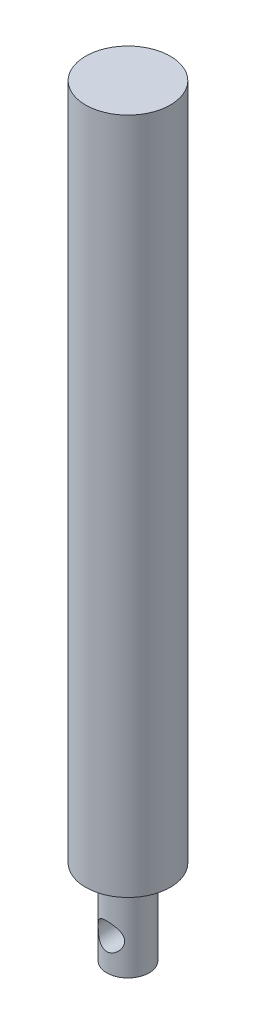
ISO-10303-21;
HEADER;
FILE_DESCRIPTION(('STEP AP214'),'2;1');
FILE_NAME('part.step','',(''),(''),'','','');
FILE_SCHEMA(('AUTOMOTIVE_DESIGN { 1 0 10303 214 1 1 1 1 }'));
ENDSEC;
DATA;
#1=APPLICATION_CONTEXT('core data for automotive mechanical design processes');
#2=APPLICATION_PROTOCOL_DEFINITION('international standard','automotive_design',2000,#1);
#3=PRODUCT_CONTEXT('',#1,'mechanical');
#4=PRODUCT('Part','Part','',(#3));
#5=PRODUCT_RELATED_PRODUCT_CATEGORY('part','',(#4));
#6=PRODUCT_DEFINITION_FORMATION('','',#4);
#7=PRODUCT_DEFINITION_CONTEXT('part definition',#1,'design');
#8=PRODUCT_DEFINITION('design','',#6,#7);
#9=PRODUCT_DEFINITION_SHAPE('','',#8);
#10=(LENGTH_UNIT() NAMED_UNIT(*) SI_UNIT(.MILLI.,.METRE.));
#11=(NAMED_UNIT(*) PLANE_ANGLE_UNIT() SI_UNIT($,.RADIAN.));
#12=(NAMED_UNIT(*) SI_UNIT($,.STERADIAN.) SOLID_ANGLE_UNIT());
#13=UNCERTAINTY_MEASURE_WITH_UNIT(LENGTH_MEASURE(1.E-05),#10,'distance_accuracy_value','');
#14=(GEOMETRIC_REPRESENTATION_CONTEXT(3) GLOBAL_UNCERTAINTY_ASSIGNED_CONTEXT((#13)) GLOBAL_UNIT_ASSIGNED_CONTEXT((#10,
#11,#12)) REPRESENTATION_CONTEXT('',''));
#15=CARTESIAN_POINT('',(0.,0.,0.));
#16=DIRECTION('',(0.,0.,1.));
#17=DIRECTION('',(1.,0.,0.));
#18=AXIS2_PLACEMENT_3D('',#15,#16,#17);
#19=CARTESIAN_POINT('',(0.,203.2,0.));
#20=DIRECTION('',(0.,-1.,0.));
#21=DIRECTION('',(0.,0.,-1.));
#22=AXIS2_PLACEMENT_3D('',#19,#20,#21);
#23=CYLINDRICAL_SURFACE('',#22,12.7);
#24=CARTESIAN_POINT('',(0.,203.2,0.));
#25=DIRECTION('',(0.,1.,0.));
#26=DIRECTION('',(0.,0.,1.));
#27=AXIS2_PLACEMENT_3D('',#24,#25,#26);
#28=CIRCLE('',#27,12.7);
#29=CARTESIAN_POINT('',(0.,203.2,12.7));
#30=VERTEX_POINT('',#29);
#31=EDGE_CURVE('E10',#30,#30,#28,.T.);
#32=ORIENTED_EDGE('',*,*,#31,.F.);
#33=EDGE_LOOP('',(#32));
#34=FACE_BOUND('',#33,.T.);
#35=CARTESIAN_POINT('',(0.,0.,0.));
#36=DIRECTION('',(0.,1.,0.));
#37=DIRECTION('',(0.,0.,1.));
#38=AXIS2_PLACEMENT_3D('',#35,#36,#37);
#39=CIRCLE('',#38,12.7);
#40=CARTESIAN_POINT('',(0.,0.,12.7));
#41=VERTEX_POINT('',#40);
#42=EDGE_CURVE('E57',#41,#41,#39,.T.);
#43=ORIENTED_EDGE('',*,*,#42,.T.);
#44=EDGE_LOOP('',(#43));
#45=FACE_BOUND('',#44,.T.);
#46=ADVANCED_FACE('F44',(#34,#45),#23,.T.);
#47=CARTESIAN_POINT('',(0.,203.2,0.));
#48=DIRECTION('',(0.,1.,0.));
#49=DIRECTION('',(0.,0.,1.));
#50=AXIS2_PLACEMENT_3D('',#47,#48,#49);
#51=PLANE('',#50);
#52=ORIENTED_EDGE('',*,*,#31,.T.);
#53=EDGE_LOOP('',(#52));
#54=FACE_BOUND('',#53,.T.);
#55=ADVANCED_FACE('F94',(#54),#51,.T.);
#56=CARTESIAN_POINT('',(0.,0.,0.));
#57=DIRECTION('',(0.,1.,0.));
#58=DIRECTION('',(0.,0.,1.));
#59=AXIS2_PLACEMENT_3D('',#56,#57,#58);
#60=PLANE('',#59);
#61=CARTESIAN_POINT('',(0.,0.,0.));
#62=DIRECTION('',(0.,1.,0.));
#63=DIRECTION('',(0.,0.,1.));
#64=AXIS2_PLACEMENT_3D('',#61,#62,#63);
#65=CIRCLE('',#64,6.35);
#66=CARTESIAN_POINT('',(0.,0.,6.35));
#67=VERTEX_POINT('',#66);
#68=EDGE_CURVE('E67',#67,#67,#65,.T.);
#69=ORIENTED_EDGE('',*,*,#68,.T.);
#70=EDGE_LOOP('',(#69));
#71=FACE_BOUND('',#70,.T.);
#72=ORIENTED_EDGE('',*,*,#42,.F.);
#73=EDGE_LOOP('',(#72));
#74=FACE_BOUND('',#73,.T.);
#75=ADVANCED_FACE('F90',(#71,#74),#60,.F.);
#76=CARTESIAN_POINT('',(0.,-25.4,0.));
#77=DIRECTION('',(0.,1.,0.));
#78=DIRECTION('',(0.,0.,1.));
#79=AXIS2_PLACEMENT_3D('',#76,#77,#78);
#80=CYLINDRICAL_SURFACE('',#79,6.35);
#81=CARTESIAN_POINT('',(0.,-19.84375,6.35));
#82=CARTESIAN_POINT('',(0.100869629316745,-19.8437497148845,6.34999972380215));
#83=CARTESIAN_POINT('',(0.201744626074195,-19.8398991259642,6.34759101835538));
#84=CARTESIAN_POINT('',(0.402721127100786,-19.8245514176762,6.33801583186877));
#85=CARTESIAN_POINT('',(0.502822276129513,-19.8130509756089,6.33084728340221));
#86=CARTESIAN_POINT('',(0.701580518465549,-19.7825414287455,6.31191404239796));
#87=CARTESIAN_POINT('',(0.800235376664191,-19.76352175969,6.30014288360457));
#88=CARTESIAN_POINT('',(0.995261867522271,-19.7182371547667,6.27229481424512));
#89=CARTESIAN_POINT('',(1.09163251289094,-19.6919691458434,6.25621607749337));
#90=CARTESIAN_POINT('',(1.37531323501,-19.6030735324116,6.20224188249421));
#91=CARTESIAN_POINT('',(1.55840926440142,-19.5301625346495,6.1584857231408));
#92=CARTESIAN_POINT('',(1.90903240198785,-19.3599183134083,6.05899553384335));
#93=CARTESIAN_POINT('',(2.07656123238679,-19.2625877958866,6.00326283113316));
#94=CARTESIAN_POINT('',(2.4065588491651,-19.0376621114467,5.87915324427494));
#95=CARTESIAN_POINT('',(2.56755512551414,-18.9082707560059,5.8101220401549));
#96=CARTESIAN_POINT('',(2.86698422438002,-18.6270285867914,5.66837011991012));
#97=CARTESIAN_POINT('',(3.00538619435875,-18.4751475939121,5.59564453375766));
#98=CARTESIAN_POINT('',(3.27478542598937,-18.1291425577706,5.44291586951387));
#99=CARTESIAN_POINT('',(3.40224107925978,-17.9320832229209,5.3632611695848));
#100=CARTESIAN_POINT('',(3.62184863294152,-17.5146816656333,5.21748377007815));
#101=CARTESIAN_POINT('',(3.71406015098582,-17.2943795727239,5.15133830786319));
#102=CARTESIAN_POINT('',(3.83963543162425,-16.8947765942964,5.05807902988526));
#103=CARTESIAN_POINT('',(3.88205827525502,-16.7196553516661,5.02529176687093));
#104=CARTESIAN_POINT('',(3.94277354635795,-16.3629786856596,4.97780809341062));
#105=CARTESIAN_POINT('',(3.96110005202576,-16.1814327226487,4.96308613611561));
#106=CARTESIAN_POINT('',(3.97252564110268,-15.8165386666315,4.95394887663679));
#107=CARTESIAN_POINT('',(3.96555856807907,-15.6331871004409,4.95958682645353));
#108=CARTESIAN_POINT('',(3.92672310654853,-15.2707654436831,4.9903825152296));
#109=CARTESIAN_POINT('',(3.89483475950964,-15.0916989033503,5.01555589928648));
#110=CARTESIAN_POINT('',(3.80898713732996,-14.7464828345544,5.08103423455141));
#111=CARTESIAN_POINT('',(3.7555487476477,-14.5801316641176,5.12098034459292));
#112=CARTESIAN_POINT('',(3.62871406027261,-14.2584135344714,5.2116215917764));
#113=CARTESIAN_POINT('',(3.55531070375237,-14.1030504847559,5.2623205292966));
#114=CARTESIAN_POINT('',(3.37486048916105,-13.7768530768272,5.38019103425625));
#115=CARTESIAN_POINT('',(3.26409033728821,-13.6085502415772,5.44867057137877));
#116=CARTESIAN_POINT('',(3.01905823407116,-13.2910940553607,5.58817880570407));
#117=CARTESIAN_POINT('',(2.88477213816952,-13.1419606618269,5.65921006267352));
#118=CARTESIAN_POINT('',(2.57018313723309,-12.8418942342447,5.80962278665086));
#119=CARTESIAN_POINT('',(2.38594341218007,-12.694724011811,5.88844834102744));
#120=CARTESIAN_POINT('',(2.08985060651593,-12.4989749899201,5.99717967914441));
#121=CARTESIAN_POINT('',(1.98780760307317,-12.4378684994638,6.03185406678168));
#122=CARTESIAN_POINT('',(1.77764139567506,-12.324621206041,6.09709452236669));
#123=CARTESIAN_POINT('',(1.66952199855952,-12.2724748708595,6.12766312276187));
#124=CARTESIAN_POINT('',(1.45381852611206,-12.1803550482438,6.18228328066744));
#125=CARTESIAN_POINT('',(1.34651469383126,-12.1398799173968,6.2065958335956));
#126=CARTESIAN_POINT('',(1.12789875245988,-12.0681585103299,6.25002000335207));
#127=CARTESIAN_POINT('',(1.0165890003298,-12.0369069037374,6.26913462361663));
#128=CARTESIAN_POINT('',(0.790959442371599,-11.9841426572887,6.30157612152695));
#129=CARTESIAN_POINT('',(0.67664243263344,-11.9626212870843,6.31490818706803));
#130=CARTESIAN_POINT('',(0.446020383866628,-11.9296732938582,6.33537355695884));
#131=CARTESIAN_POINT('',(0.329715687898617,-11.918244946434,6.34250792018845));
#132=CARTESIAN_POINT('',(0.113713520851886,-11.9066319109454,6.34976016207931));
#133=CARTESIAN_POINT('',(0.0141188560347515,-11.9050277259702,6.35076380441156));
#134=CARTESIAN_POINT('',(-0.184879721587419,-11.9093092911955,6.34808814081896));
#135=CARTESIAN_POINT('',(-0.284283566807626,-11.9151973301643,6.3444074038825));
#136=CARTESIAN_POINT('',(-0.482049788768363,-11.9343824630312,6.33245077139595));
#137=CARTESIAN_POINT('',(-0.580412622595358,-11.947676154972,6.3241769857746));
#138=CARTESIAN_POINT('',(-0.775428568607444,-11.981479841522,6.30324138384447));
#139=CARTESIAN_POINT('',(-0.872081007457273,-12.001992614506,6.29057787811232));
#140=CARTESIAN_POINT('',(-1.15088548876522,-12.0720944246193,6.2475795865219));
#141=CARTESIAN_POINT('',(-1.32992793932614,-12.1310751219652,6.21170333539774));
#142=CARTESIAN_POINT('',(-1.67528351503094,-12.2723195124059,6.12761204900109));
#143=CARTESIAN_POINT('',(-1.84159450268554,-12.3545871043006,6.07939494769579));
#144=CARTESIAN_POINT('',(-2.17513202437408,-12.5492347075568,5.96868317626299));
#145=CARTESIAN_POINT('',(-2.34075646929189,-12.6638160437951,5.90523860940441));
#146=CARTESIAN_POINT('',(-2.65158053926593,-12.9152458107188,5.77237122101155));
#147=CARTESIAN_POINT('',(-2.79675713625212,-13.0521189780887,5.70294179898969));
#148=CARTESIAN_POINT('',(-3.08442971309266,-13.3671786559964,5.55326138829567));
#149=CARTESIAN_POINT('',(-3.22347731908553,-13.548478104909,5.47290255489714));
#150=CARTESIAN_POINT('',(-3.46965140221235,-13.9346806422575,5.3202447107867));
#151=CARTESIAN_POINT('',(-3.57679997868866,-14.1395672526359,5.24794014199256));
#152=CARTESIAN_POINT('',(-3.73649146821152,-14.5246475651997,5.13503958826746));
#153=CARTESIAN_POINT('',(-3.79577268273818,-14.7010143817285,5.09097394791043));
#154=CARTESIAN_POINT('',(-3.88937844621214,-15.0634482391939,5.01983472205991));
#155=CARTESIAN_POINT('',(-3.9237419934895,-15.2494996315799,4.99273459318101));
#156=CARTESIAN_POINT('',(-3.96561893072445,-15.6276366274951,4.95955081816445));
#157=CARTESIAN_POINT('',(-3.97297869579013,-15.8197505039366,4.95358742571596));
#158=CARTESIAN_POINT('',(-3.95985296455014,-16.2024408041522,4.96408275619006));
#159=CARTESIAN_POINT('',(-3.93935821277103,-16.3930166957164,4.98054893199321));
#160=CARTESIAN_POINT('',(-3.87471518477694,-16.751394582422,5.03095858468029));
#161=CARTESIAN_POINT('',(-3.83260357399809,-16.9197949714346,5.06338862387179));
#162=CARTESIAN_POINT('',(-3.7280094149118,-17.247028875334,5.14088162029399));
#163=CARTESIAN_POINT('',(-3.66551837191228,-17.4058583680505,5.18594984435844));
#164=CARTESIAN_POINT('',(-3.51163597607084,-17.7342694023257,5.29157878767792));
#165=CARTESIAN_POINT('',(-3.41737041979665,-17.9020786648252,5.35343780308803));
#166=CARTESIAN_POINT('',(-3.20674833077802,-18.2211303496818,5.48220019424994));
#167=CARTESIAN_POINT('',(-3.09037393827033,-18.3723592213684,5.54910762164007));
#168=CARTESIAN_POINT('',(-2.81201288386465,-18.6849156149845,5.69600834809494));
#169=CARTESIAN_POINT('',(-2.64555740186451,-18.8423069993518,5.77596775379648));
#170=CARTESIAN_POINT('',(-2.28539575501072,-19.1277900309385,5.92769410201568));
#171=CARTESIAN_POINT('',(-2.09167283421129,-19.2558635341499,5.99945595761419));
#172=CARTESIAN_POINT('',(-1.78349840023067,-19.4223694923273,6.09535255501647));
#173=CARTESIAN_POINT('',(-1.67766361859263,-19.4736638127035,6.12539791198672));
#174=CARTESIAN_POINT('',(-1.46081667034857,-19.5670047267177,6.18069576198291));
#175=CARTESIAN_POINT('',(-1.34980753956171,-19.6090566621584,6.20595102236847));
#176=CARTESIAN_POINT('',(-1.12374968935667,-19.6831857738524,6.25083486710867));
#177=CARTESIAN_POINT('',(-1.00871279453018,-19.7152898031161,6.27047858763776));
#178=CARTESIAN_POINT('',(-0.77542469397498,-19.7690983236553,6.30357618597448));
#179=CARTESIAN_POINT('',(-0.657175927267378,-19.790810485169,6.31703462884307));
#180=CARTESIAN_POINT('',(-0.449030670968347,-19.8192878659657,6.33473309529463));
#181=CARTESIAN_POINT('',(-0.359578266529578,-19.8284508701369,6.34044755472161));
#182=CARTESIAN_POINT('',(-0.180085357844226,-19.8406822530264,6.34808124780582));
#183=CARTESIAN_POINT('',(-0.0900448175432499,-19.8437502545183,6.35000024655771));
#184=CARTESIAN_POINT('',(0.,-19.84375,6.35));
#185=B_SPLINE_CURVE_WITH_KNOTS('',3,(#81,#82,#83,#84,#85,#86,#87,#88,#89,#90,#91,#92,#93,#94,
#95,#96,#97,#98,#99,#100,#101,#102,#103,#104,#105,#106,#107,#108,#109,#110,#111,#112,#113,#114,
#115,#116,#117,#118,#119,#120,#121,#122,#123,#124,#125,#126,#127,#128,#129,#130,#131,#132,#133,
#134,#135,#136,#137,#138,#139,#140,#141,#142,#143,#144,#145,#146,#147,#148,#149,#150,#151,#152,
#153,#154,#155,#156,#157,#158,#159,#160,#161,#162,#163,#164,#165,#166,#167,#168,#169,#170,#171,
#172,#173,#174,#175,#176,#177,#178,#179,#180,#181,#182,#183,#184),.UNSPECIFIED.,.T.,.F.,(4,2,2,
2,2,2,2,2,2,2,2,2,2,2,2,2,2,2,2,2,2,2,2,2,2,2,2,2,2,2,2,2,2,2,2,2,2,2,2,2,2,2,2,2,2,2,2,2,2,2,2,
4),(0.,0.302516233516313,0.605163950281537,0.908238396646871,1.21144153446557,1.81418065622226,
2.41685301718088,3.0676544095602,3.71933716994873,4.45928195393961,5.19796947688028,
5.74512625253872,6.29150837756736,6.83932061669391,7.38757202864409,7.92329787351777,
8.45921337676083,9.09524151943532,9.73192656244117,10.473659207889,10.8449007236979,
11.2159121959634,11.5670941342049,11.9180727214837,12.2687357690592,12.6193388939245,
12.9177954973323,13.2163432968997,13.5147540646189,13.8132798061551,14.3863282790239,
14.959472751134,15.5904700941052,16.2221724704342,16.9455752665781,17.6684757236571,
18.2398396151684,18.8103073306438,19.3840154566203,19.9579142604226,20.4856196272713,
21.0135452375688,21.6178993667911,22.2227437919992,22.9474311247318,23.6725657407344,
24.0362656723034,24.3997548409226,24.7622540963255,25.1244853768117,25.3945204059581,
25.664572147353),.UNSPECIFIED.);
#186=CARTESIAN_POINT('',(0.,-19.84375,6.35));
#187=VERTEX_POINT('',#186);
#188=EDGE_CURVE('E47',#187,#187,#185,.T.);
#189=ORIENTED_EDGE('',*,*,#188,.F.);
#190=EDGE_LOOP('',(#189));
#191=FACE_BOUND('',#190,.T.);
#192=CARTESIAN_POINT('',(3.96875,-15.875,-4.95696716122873));
#193=CARTESIAN_POINT('',(3.96874900573419,-15.9736710602069,-4.95696874271391));
#194=CARTESIAN_POINT('',(3.96506285378441,-16.0723611050935,-4.95992621673895));
#195=CARTESIAN_POINT('',(3.95038568680392,-16.2688923615109,-4.97162322998739));
#196=CARTESIAN_POINT('',(3.93939036932624,-16.3667330386874,-4.98036617474047));
#197=CARTESIAN_POINT('',(3.91026400431771,-16.5609054847003,-5.00326674172933));
#198=CARTESIAN_POINT('',(3.89211856248577,-16.6572337996005,-5.0174352848972));
#199=CARTESIAN_POINT('',(3.84898958559458,-16.8475171526472,-5.05059553757727));
#200=CARTESIAN_POINT('',(3.82400263212465,-16.9414709786609,-5.06958965788085));
#201=CARTESIAN_POINT('',(3.73979784747683,-17.2172176385898,-5.13237726434778));
#202=CARTESIAN_POINT('',(3.67103875807196,-17.3948102631118,-5.18222582698263));
#203=CARTESIAN_POINT('',(3.51065055159705,-17.7356105560387,-5.29218769633264));
#204=CARTESIAN_POINT('',(3.41902081068752,-17.8988178318921,-5.35230128303126));
#205=CARTESIAN_POINT('',(3.20116953144064,-18.2304066215122,-5.48574914610402));
#206=CARTESIAN_POINT('',(3.07195643927916,-18.3965449387693,-5.55977514499705));
#207=CARTESIAN_POINT('',(2.78860064257225,-18.7067509533842,-5.70716191438484));
#208=CARTESIAN_POINT('',(2.63443645462852,-18.8507994209,-5.7805220535563));
#209=CARTESIAN_POINT('',(2.37613926731808,-19.056037470055,-5.88953746389587));
#210=CARTESIAN_POINT('',(2.2797522354883,-19.1258414578107,-5.92760745108176));
#211=CARTESIAN_POINT('',(2.0802493775974,-19.2569778668479,-6.00052676804366));
#212=CARTESIAN_POINT('',(1.97713640155103,-19.318313842421,-6.03537744701976));
#213=CARTESIAN_POINT('',(1.76477431294211,-19.4318297607427,-6.10085360734356));
#214=CARTESIAN_POINT('',(1.65552823858491,-19.4840141850511,-6.13148115519993));
#215=CARTESIAN_POINT('',(1.43159316429791,-19.578549503353,-6.18759679112286));
#216=CARTESIAN_POINT('',(1.31690515876955,-19.6209021856253,-6.2130858137159));
#217=CARTESIAN_POINT('',(1.09492280953989,-19.6913161965639,-6.25580472432561));
#218=CARTESIAN_POINT('',(0.988060807618214,-19.720392218557,-6.27361056339239));
#219=CARTESIAN_POINT('',(0.771565275150485,-19.7696092220453,-6.30389777693923));
#220=CARTESIAN_POINT('',(0.661932208064744,-19.7897516873609,-6.31638003562699));
#221=CARTESIAN_POINT('',(0.440955340620525,-19.8207537239981,-6.33564111080196));
#222=CARTESIAN_POINT('',(0.329613026614533,-19.8316209418487,-6.34242462527042));
#223=CARTESIAN_POINT('',(0.106212272680803,-19.8439050696517,-6.35009507371279));
#224=CARTESIAN_POINT('',(-0.00584608333256258,-19.8453230673588,-6.35098268639825));
#225=CARTESIAN_POINT('',(-0.214504374891968,-19.8391320975868,-6.34711449983047));
#226=CARTESIAN_POINT('',(-0.311155327802995,-19.8327121795876,-6.34310204154902));
#227=CARTESIAN_POINT('',(-0.503464711140016,-19.8128752242534,-6.3307448174341));
#228=CARTESIAN_POINT('',(-0.599122835923828,-19.7994560937738,-6.32239875562129));
#229=CARTESIAN_POINT('',(-0.883515880940101,-19.7489312475588,-6.29111464724018));
#230=CARTESIAN_POINT('',(-1.06986326806675,-19.7015519001942,-6.26192655941664));
#231=CARTESIAN_POINT('',(-1.43160192720786,-19.5814806134875,-6.1892851361174));
#232=CARTESIAN_POINT('',(-1.60696380127574,-19.5087239128365,-6.14579531998115));
#233=CARTESIAN_POINT('',(-1.94315322662831,-19.3406123480059,-6.04791900743893));
#234=CARTESIAN_POINT('',(-2.10397745512777,-19.2452523354686,-5.99353002896703));
#235=CARTESIAN_POINT('',(-2.42796788941351,-19.0213353699321,-5.87035983359767));
#236=CARTESIAN_POINT('',(-2.5889348616174,-18.8901240051711,-5.8006298711353));
#237=CARTESIAN_POINT('',(-2.88797487368485,-18.6050797484186,-5.65770595500896));
#238=CARTESIAN_POINT('',(-3.02601401187134,-18.4512139817055,-5.58450707393901));
#239=CARTESIAN_POINT('',(-3.29360062054489,-18.1016096295464,-5.43151828233587));
#240=CARTESIAN_POINT('',(-3.4196850967378,-17.9030268613829,-5.35211595968415));
#241=CARTESIAN_POINT('',(-3.63620530690335,-17.4826735750668,-5.20744891427342));
#242=CARTESIAN_POINT('',(-3.72670670786939,-17.2609467347744,-5.14215825033774));
#243=CARTESIAN_POINT('',(-3.84868950645596,-16.8599821444911,-5.05116708155986));
#244=CARTESIAN_POINT('',(-3.88943347435477,-16.6849076918597,-5.01957036252242));
#245=CARTESIAN_POINT('',(-3.94684785137588,-16.328659277485,-4.97456265847659));
#246=CARTESIAN_POINT('',(-3.9635511492972,-16.1474939964094,-4.9611268300272));
#247=CARTESIAN_POINT('',(-3.97187850645185,-15.7837864335601,-4.95446474235017));
#248=CARTESIAN_POINT('',(-3.96344509290585,-15.6012419495108,-4.96128479620856));
#249=CARTESIAN_POINT('',(-3.92194208058627,-15.2406966763945,-4.99414935063267));
#250=CARTESIAN_POINT('',(-3.88885207959911,-15.0626997764739,-5.02020977157));
#251=CARTESIAN_POINT('',(-3.80063156106316,-14.7186065535341,-5.08730446176149));
#252=CARTESIAN_POINT('',(-3.74587336086038,-14.5523624244694,-5.12808481393473));
#253=CARTESIAN_POINT('',(-3.61640339779164,-14.2310255000156,-5.2201943145731));
#254=CARTESIAN_POINT('',(-3.54168455291001,-14.0759366873578,-5.27152720557506));
#255=CARTESIAN_POINT('',(-3.35804827456008,-13.7499520488877,-5.39074435246793));
#256=CARTESIAN_POINT('',(-3.24532821601102,-13.5816683704813,-5.45991909480843));
#257=CARTESIAN_POINT('',(-2.99622649795443,-13.264567649456,-5.6005056213583));
#258=CARTESIAN_POINT('',(-2.85982028941315,-13.1157710873508,-5.67191966289017));
#259=CARTESIAN_POINT('',(-2.54116539897778,-12.8175055719776,-5.82242654300694));
#260=CARTESIAN_POINT('',(-2.35507330809824,-12.6717515834257,-5.9009154708021));
#261=CARTESIAN_POINT('',(-2.05629732144542,-12.4784230180641,-6.00878011994655));
#262=CARTESIAN_POINT('',(-1.95337856452997,-12.4181745395426,-6.04310422735716));
#263=CARTESIAN_POINT('',(-1.74151127276995,-12.3067492779841,-6.1075249387584));
#264=CARTESIAN_POINT('',(-1.63256657311219,-12.2555668101497,-6.13762418944913));
#265=CARTESIAN_POINT('',(-1.41596484367067,-12.1656943566171,-6.19106192892849));
#266=CARTESIAN_POINT('',(-1.30861254813102,-12.1264446622781,-6.21469493407564));
#267=CARTESIAN_POINT('',(-1.09003485121242,-12.0571561337075,-6.25673203585057));
#268=CARTESIAN_POINT('',(-0.978811733467164,-12.0271119678152,-6.2751391587511));
#269=CARTESIAN_POINT('',(-0.75349473397272,-11.97672636573,-6.30616102496652));
#270=CARTESIAN_POINT('',(-0.63940344824341,-11.9563764659687,-6.31878082054033));
#271=CARTESIAN_POINT('',(-0.409374956656546,-11.9257159272083,-6.33784052403798));
#272=CARTESIAN_POINT('',(-0.293438059389599,-11.915403627451,-6.34428145427557));
#273=CARTESIAN_POINT('',(-0.0781479325996276,-11.9057802934148,-6.35029285323319));
#274=CARTESIAN_POINT('',(0.0211214404538159,-11.9050675096965,-6.35073872013369));
#275=CARTESIAN_POINT('',(0.219379742648351,-11.9110768430608,-6.3469838780748));
#276=CARTESIAN_POINT('',(0.318368576926835,-11.917801229875,-6.34278175060543));
#277=CARTESIAN_POINT('',(0.515228595163441,-11.9385923693547,-6.32983107242293));
#278=CARTESIAN_POINT('',(0.613100251321333,-11.9526558929446,-6.32108452117412));
#279=CARTESIAN_POINT('',(0.807069875129154,-11.9879252378496,-6.29926083182129));
#280=CARTESIAN_POINT('',(0.90316714369822,-12.0091338134357,-6.28618202375389));
#281=CARTESIAN_POINT('',(1.18111938882744,-12.0813704661347,-6.24193052654393));
#282=CARTESIAN_POINT('',(1.35975783413935,-12.1418021974719,-6.20523279759309));
#283=CARTESIAN_POINT('',(1.70409986680027,-12.2858564916743,-6.11965162494569));
#284=CARTESIAN_POINT('',(1.86980126581786,-12.3694829671401,-6.07076612549846));
#285=CARTESIAN_POINT('',(2.20235034138367,-12.5671589178098,-5.95869246769898));
#286=CARTESIAN_POINT('',(2.36753184575987,-12.6834651996625,-5.89454643022083));
#287=CARTESIAN_POINT('',(2.67721529241243,-12.9383676415839,-5.76051798247477));
#288=CARTESIAN_POINT('',(2.8216935487031,-13.0769889528148,-5.69062914355594));
#289=CARTESIAN_POINT('',(3.10744694557892,-13.3956982093495,-5.54038824335725));
#290=CARTESIAN_POINT('',(3.24525860579624,-13.5788831136607,-5.45998005910693));
#291=CARTESIAN_POINT('',(3.48860381232705,-13.968855206071,-5.30780044192229));
#292=CARTESIAN_POINT('',(3.59415521064981,-14.1756292532194,-5.23602424565204));
#293=CARTESIAN_POINT('',(3.74965107255956,-14.5618774227209,-5.12539577935228));
#294=CARTESIAN_POINT('',(3.80671941361063,-14.7373563286204,-5.08277435476138));
#295=CARTESIAN_POINT('',(3.87383024583867,-15.0072378750259,-5.03157137984087));
#296=CARTESIAN_POINT('',(3.89310844988638,-15.0982140894708,-5.01663389594777));
#297=CARTESIAN_POINT('',(3.92529036450986,-15.2819150242269,-4.99149479913686));
#298=CARTESIAN_POINT('',(3.93819735521796,-15.374638819238,-4.9812907494384));
#299=CARTESIAN_POINT('',(3.95477232469409,-15.5353582748798,-4.96813355656885));
#300=CARTESIAN_POINT('',(3.96000843964951,-15.603098300357,-4.96395541707157));
#301=CARTESIAN_POINT('',(3.96699805810774,-15.7388891571641,-4.95837132540193));
#302=CARTESIAN_POINT('',(3.9687506858107,-15.8069400623444,-4.9569660703741));
#303=CARTESIAN_POINT('',(3.96875,-15.875,-4.95696716122873));
#304=B_SPLINE_CURVE_WITH_KNOTS('',3,(#192,#193,#194,#195,#196,#197,#198,#199,#200,#201,#202,
#203,#204,#205,#206,#207,#208,#209,#210,#211,#212,#213,#214,#215,#216,#217,#218,#219,#220,#221,
#222,#223,#224,#225,#226,#227,#228,#229,#230,#231,#232,#233,#234,#235,#236,#237,#238,#239,#240,
#241,#242,#243,#244,#245,#246,#247,#248,#249,#250,#251,#252,#253,#254,#255,#256,#257,#258,#259,
#260,#261,#262,#263,#264,#265,#266,#267,#268,#269,#270,#271,#272,#273,#274,#275,#276,#277,#278,
#279,#280,#281,#282,#283,#284,#285,#286,#287,#288,#289,#290,#291,#292,#293,#294,#295,#296,#297,
#298,#299,#300,#301,#302,#303),.UNSPECIFIED.,.T.,.F.,(4,2,2,2,2,2,2,2,2,2,2,2,2,2,2,2,2,2,2,2,2,
2,2,2,2,2,2,2,2,2,2,2,2,2,2,2,2,2,2,2,2,2,2,2,2,2,2,2,2,2,2,2,2,2,2,4),(0.,0.29593431392531,
0.592042980241266,0.888750829635212,1.18560720264541,1.7735343406487,2.36147751720907,
3.02829640855696,3.69569252911842,4.07010970882502,4.44436925292617,4.8184450053661,
5.19245266439819,5.52846904453002,5.86442959304822,6.20011290688647,6.53575757759561,
6.82623573236151,7.11680080571322,7.69735665161288,8.27940500966086,8.86158606850619,
9.51621768733323,10.171808806416,10.9130133154004,11.6528434707381,12.1980852804615,
12.7425804616945,13.2883215353565,13.8345146872956,14.3717041509117,14.9090844624991,
15.5487757511578,16.189134035937,16.9321316665134,17.3039854096408,17.6756051518581,
18.0252521528444,18.3746962606994,18.7238347250934,19.0729154134038,19.3703566292702,
19.6678886455433,19.9652898638265,20.2628058555983,20.8365523841837,21.4103957540035,
22.0438008902535,22.6779249982449,23.4034525179255,24.1285778191369,24.6942514618864,
24.9765210922841,25.2586452480485,25.4627193607113,25.666844774117),.UNSPECIFIED.);
#305=CARTESIAN_POINT('',(3.96875,-15.875,-4.95696716122873));
#306=VERTEX_POINT('',#305);
#307=EDGE_CURVE('E69',#306,#306,#304,.T.);
#308=ORIENTED_EDGE('',*,*,#307,.F.);
#309=EDGE_LOOP('',(#308));
#310=FACE_BOUND('',#309,.T.);
#311=CARTESIAN_POINT('',(0.,-25.4,0.));
#312=DIRECTION('',(0.,1.,0.));
#313=DIRECTION('',(0.,0.,1.));
#314=AXIS2_PLACEMENT_3D('',#311,#312,#313);
#315=CIRCLE('',#314,6.35);
#316=CARTESIAN_POINT('',(0.,-25.4,6.35));
#317=VERTEX_POINT('',#316);
#318=EDGE_CURVE('E64',#317,#317,#315,.T.);
#319=ORIENTED_EDGE('',*,*,#318,.T.);
#320=EDGE_LOOP('',(#319));
#321=FACE_BOUND('',#320,.T.);
#322=ORIENTED_EDGE('',*,*,#68,.F.);
#323=EDGE_LOOP('',(#322));
#324=FACE_BOUND('',#323,.T.);
#325=ADVANCED_FACE('F75',(#191,#310,#321,#324),#80,.T.);
#326=CARTESIAN_POINT('',(0.,-25.4,0.));
#327=DIRECTION('',(0.,1.,0.));
#328=DIRECTION('',(0.,0.,1.));
#329=AXIS2_PLACEMENT_3D('',#326,#327,#328);
#330=PLANE('',#329);
#331=ORIENTED_EDGE('',*,*,#318,.F.);
#332=EDGE_LOOP('',(#331));
#333=FACE_BOUND('',#332,.T.);
#334=ADVANCED_FACE('F82',(#333),#330,.F.);
#335=CARTESIAN_POINT('',(0.,-15.875,-12.7));
#336=DIRECTION('',(0.,0.,1.));
#337=DIRECTION('',(1.,0.,0.));
#338=AXIS2_PLACEMENT_3D('',#335,#336,#337);
#339=CYLINDRICAL_SURFACE('',#338,3.96875);
#340=ORIENTED_EDGE('',*,*,#188,.T.);
#341=EDGE_LOOP('',(#340));
#342=FACE_BOUND('',#341,.T.);
#343=ORIENTED_EDGE('',*,*,#307,.T.);
#344=EDGE_LOOP('',(#343));
#345=FACE_BOUND('',#344,.T.);
#346=ADVANCED_FACE('F79',(#342,#345),#339,.F.);
#347=CLOSED_SHELL('',(#46,#55,#75,#325,#334,#346));
#348=MANIFOLD_SOLID_BREP('B2',#347);
#349=ADVANCED_BREP_SHAPE_REPRESENTATION('',(#18,#348),#14);
#350=SHAPE_DEFINITION_REPRESENTATION(#9,#349);
ENDSEC;
END-ISO-10303-21;
